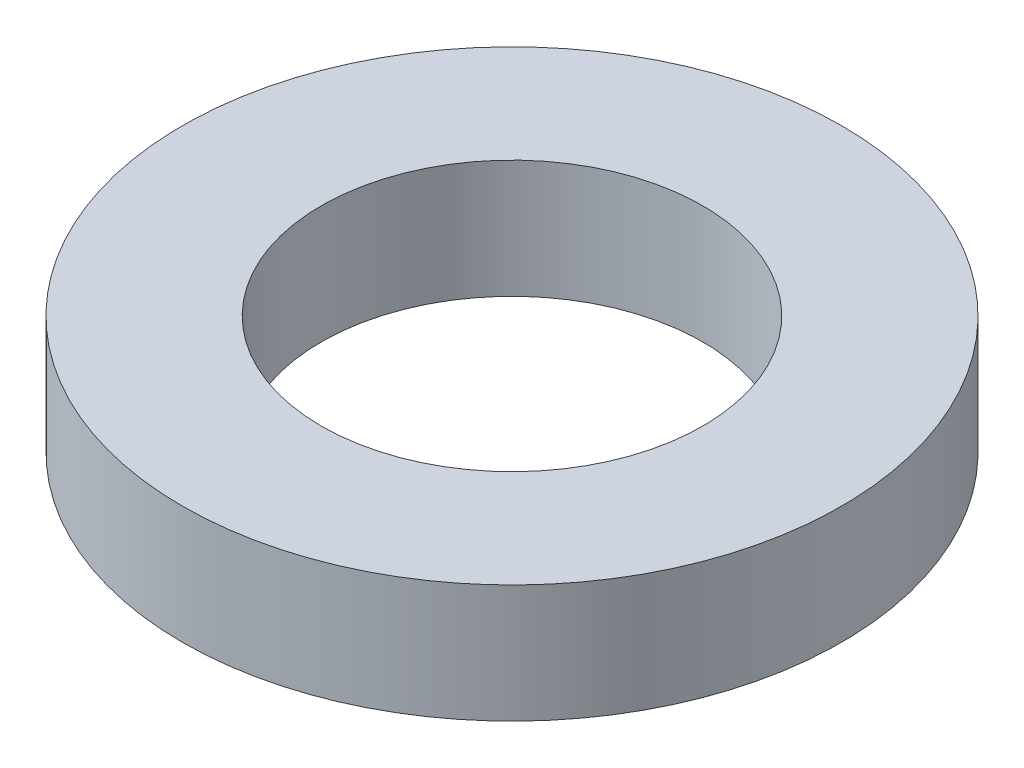
ISO-10303-21;
HEADER;
FILE_DESCRIPTION(('STEP AP214'),'2;1');
FILE_NAME('part.step','',(''),(''),'','','');
FILE_SCHEMA(('AUTOMOTIVE_DESIGN { 1 0 10303 214 1 1 1 1 }'));
ENDSEC;
DATA;
#1=APPLICATION_CONTEXT('core data for automotive mechanical design processes');
#2=APPLICATION_PROTOCOL_DEFINITION('international standard','automotive_design',2000,#1);
#3=PRODUCT_CONTEXT('',#1,'mechanical');
#4=PRODUCT('Part','Part','',(#3));
#5=PRODUCT_RELATED_PRODUCT_CATEGORY('part','',(#4));
#6=PRODUCT_DEFINITION_FORMATION('','',#4);
#7=PRODUCT_DEFINITION_CONTEXT('part definition',#1,'design');
#8=PRODUCT_DEFINITION('design','',#6,#7);
#9=PRODUCT_DEFINITION_SHAPE('','',#8);
#10=(LENGTH_UNIT() NAMED_UNIT(*) SI_UNIT(.MILLI.,.METRE.));
#11=(NAMED_UNIT(*) PLANE_ANGLE_UNIT() SI_UNIT($,.RADIAN.));
#12=(NAMED_UNIT(*) SI_UNIT($,.STERADIAN.) SOLID_ANGLE_UNIT());
#13=UNCERTAINTY_MEASURE_WITH_UNIT(LENGTH_MEASURE(1.E-05),#10,'distance_accuracy_value','');
#14=(GEOMETRIC_REPRESENTATION_CONTEXT(3) GLOBAL_UNCERTAINTY_ASSIGNED_CONTEXT((#13)) GLOBAL_UNIT_ASSIGNED_CONTEXT((#10,
#11,#12)) REPRESENTATION_CONTEXT('',''));
#15=CARTESIAN_POINT('',(0.,0.,0.));
#16=DIRECTION('',(0.,0.,1.));
#17=DIRECTION('',(1.,0.,0.));
#18=AXIS2_PLACEMENT_3D('',#15,#16,#17);
#19=CARTESIAN_POINT('',(0.,17.,0.));
#20=DIRECTION('',(0.,-1.,0.));
#21=DIRECTION('',(0.,0.,-1.));
#22=AXIS2_PLACEMENT_3D('',#19,#20,#21);
#23=CYLINDRICAL_SURFACE('',#22,47.5);
#24=CARTESIAN_POINT('',(0.,17.,0.));
#25=DIRECTION('',(0.,1.,0.));
#26=DIRECTION('',(0.,0.,1.));
#27=AXIS2_PLACEMENT_3D('',#24,#25,#26);
#28=CIRCLE('',#27,47.5);
#29=CARTESIAN_POINT('',(0.,17.,47.5));
#30=VERTEX_POINT('',#29);
#31=EDGE_CURVE('E10',#30,#30,#28,.T.);
#32=ORIENTED_EDGE('',*,*,#31,.F.);
#33=EDGE_LOOP('',(#32));
#34=FACE_BOUND('',#33,.T.);
#35=CARTESIAN_POINT('',(0.,0.,0.));
#36=DIRECTION('',(0.,1.,0.));
#37=DIRECTION('',(0.,0.,1.));
#38=AXIS2_PLACEMENT_3D('',#35,#36,#37);
#39=CIRCLE('',#38,47.5);
#40=CARTESIAN_POINT('',(0.,0.,47.5));
#41=VERTEX_POINT('',#40);
#42=EDGE_CURVE('E37',#41,#41,#39,.T.);
#43=ORIENTED_EDGE('',*,*,#42,.T.);
#44=EDGE_LOOP('',(#43));
#45=FACE_BOUND('',#44,.T.);
#46=ADVANCED_FACE('F40',(#34,#45),#23,.T.);
#47=CARTESIAN_POINT('',(0.,17.,0.));
#48=DIRECTION('',(0.,1.,0.));
#49=DIRECTION('',(0.,0.,1.));
#50=AXIS2_PLACEMENT_3D('',#47,#48,#49);
#51=PLANE('',#50);
#52=CARTESIAN_POINT('',(0.,17.,0.));
#53=DIRECTION('',(0.,1.,0.));
#54=DIRECTION('',(0.,0.,1.));
#55=AXIS2_PLACEMENT_3D('',#52,#53,#54);
#56=CIRCLE('',#55,27.5);
#57=CARTESIAN_POINT('',(0.,17.,27.5));
#58=VERTEX_POINT('',#57);
#59=EDGE_CURVE('E50',#58,#58,#56,.T.);
#60=ORIENTED_EDGE('',*,*,#59,.F.);
#61=EDGE_LOOP('',(#60));
#62=FACE_BOUND('',#61,.T.);
#63=ORIENTED_EDGE('',*,*,#31,.T.);
#64=EDGE_LOOP('',(#63));
#65=FACE_BOUND('',#64,.T.);
#66=ADVANCED_FACE('F59',(#62,#65),#51,.T.);
#67=CARTESIAN_POINT('',(0.,0.,0.));
#68=DIRECTION('',(0.,1.,0.));
#69=DIRECTION('',(0.,0.,1.));
#70=AXIS2_PLACEMENT_3D('',#67,#68,#69);
#71=PLANE('',#70);
#72=CARTESIAN_POINT('',(0.,0.,0.));
#73=DIRECTION('',(0.,1.,0.));
#74=DIRECTION('',(0.,0.,1.));
#75=AXIS2_PLACEMENT_3D('',#72,#73,#74);
#76=CIRCLE('',#75,27.5);
#77=CARTESIAN_POINT('',(0.,0.,27.5));
#78=VERTEX_POINT('',#77);
#79=EDGE_CURVE('E47',#78,#78,#76,.T.);
#80=ORIENTED_EDGE('',*,*,#79,.T.);
#81=EDGE_LOOP('',(#80));
#82=FACE_BOUND('',#81,.T.);
#83=ORIENTED_EDGE('',*,*,#42,.F.);
#84=EDGE_LOOP('',(#83));
#85=FACE_BOUND('',#84,.T.);
#86=ADVANCED_FACE('F58',(#82,#85),#71,.F.);
#87=CARTESIAN_POINT('',(0.,17.,0.));
#88=DIRECTION('',(0.,-1.,0.));
#89=DIRECTION('',(0.,0.,-1.));
#90=AXIS2_PLACEMENT_3D('',#87,#88,#89);
#91=CYLINDRICAL_SURFACE('',#90,27.5);
#92=ORIENTED_EDGE('',*,*,#59,.T.);
#93=EDGE_LOOP('',(#92));
#94=FACE_BOUND('',#93,.T.);
#95=ORIENTED_EDGE('',*,*,#79,.F.);
#96=EDGE_LOOP('',(#95));
#97=FACE_BOUND('',#96,.T.);
#98=ADVANCED_FACE('F54',(#94,#97),#91,.F.);
#99=CLOSED_SHELL('',(#46,#66,#86,#98));
#100=MANIFOLD_SOLID_BREP('B2',#99);
#101=ADVANCED_BREP_SHAPE_REPRESENTATION('',(#18,#100),#14);
#102=SHAPE_DEFINITION_REPRESENTATION(#9,#101);
ENDSEC;
END-ISO-10303-21;
